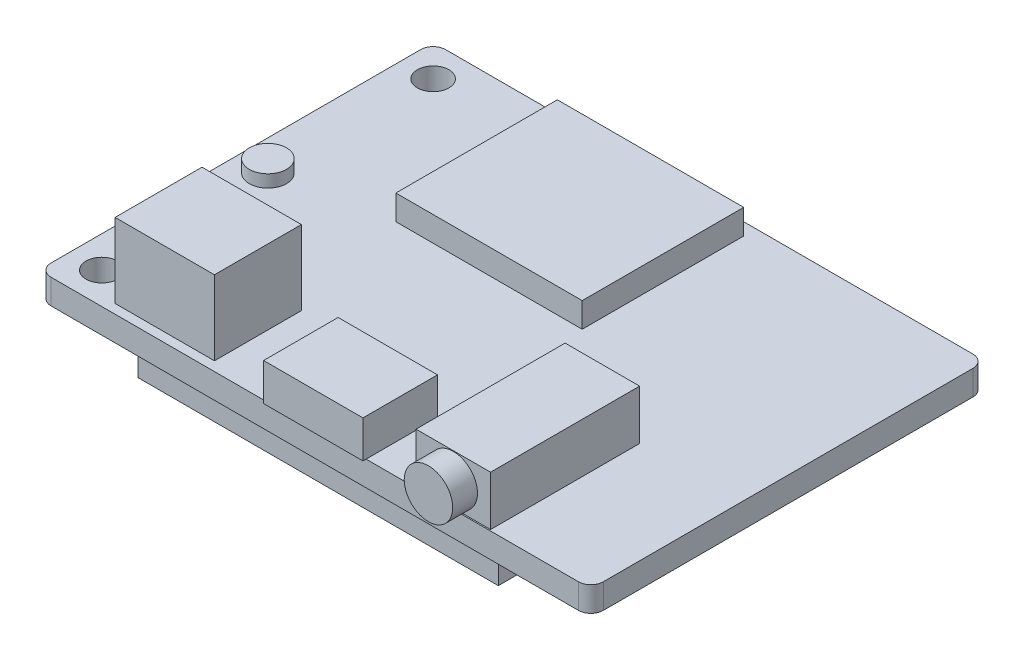
ISO-10303-21;
HEADER;
FILE_DESCRIPTION(('STEP AP214'),'2;1');
FILE_NAME('part.step','',(''),(''),'','','');
FILE_SCHEMA(('AUTOMOTIVE_DESIGN { 1 0 10303 214 1 1 1 1 }'));
ENDSEC;
DATA;
#1=APPLICATION_CONTEXT('core data for automotive mechanical design processes');
#2=APPLICATION_PROTOCOL_DEFINITION('international standard','automotive_design',2000,#1);
#3=PRODUCT_CONTEXT('',#1,'mechanical');
#4=PRODUCT('Part','Part','',(#3));
#5=PRODUCT_RELATED_PRODUCT_CATEGORY('part','',(#4));
#6=PRODUCT_DEFINITION_FORMATION('','',#4);
#7=PRODUCT_DEFINITION_CONTEXT('part definition',#1,'design');
#8=PRODUCT_DEFINITION('design','',#6,#7);
#9=PRODUCT_DEFINITION_SHAPE('','',#8);
#10=(LENGTH_UNIT() NAMED_UNIT(*) SI_UNIT(.MILLI.,.METRE.));
#11=(NAMED_UNIT(*) PLANE_ANGLE_UNIT() SI_UNIT($,.RADIAN.));
#12=(NAMED_UNIT(*) SI_UNIT($,.STERADIAN.) SOLID_ANGLE_UNIT());
#13=UNCERTAINTY_MEASURE_WITH_UNIT(LENGTH_MEASURE(1.E-05),#10,'distance_accuracy_value','');
#14=(GEOMETRIC_REPRESENTATION_CONTEXT(3) GLOBAL_UNCERTAINTY_ASSIGNED_CONTEXT((#13)) GLOBAL_UNIT_ASSIGNED_CONTEXT((#10,
#11,#12)) REPRESENTATION_CONTEXT('',''));
#15=CARTESIAN_POINT('',(0.,0.,0.));
#16=DIRECTION('',(0.,0.,1.));
#17=DIRECTION('',(1.,0.,0.));
#18=AXIS2_PLACEMENT_3D('',#15,#16,#17);
#19=CARTESIAN_POINT('',(0.,0.,0.));
#20=DIRECTION('',(0.,1.,0.));
#21=DIRECTION('',(0.,0.,1.));
#22=AXIS2_PLACEMENT_3D('',#19,#20,#21);
#23=PLANE('',#22);
#24=DIRECTION('',(0.,0.,-1.));
#25=VECTOR('',#24,1.);
#26=CARTESIAN_POINT('',(22.225,0.,-15.875));
#27=LINE('',#26,#25);
#28=CARTESIAN_POINT('',(22.225,0.,14.875));
#29=VERTEX_POINT('',#28);
#30=CARTESIAN_POINT('',(22.225,0.,-14.875));
#31=VERTEX_POINT('',#30);
#32=EDGE_CURVE('E391',#29,#31,#27,.T.);
#33=ORIENTED_EDGE('',*,*,#32,.F.);
#34=CARTESIAN_POINT('',(21.225,0.,14.875));
#35=DIRECTION('',(0.,1.,0.));
#36=DIRECTION('',(0.,0.,1.));
#37=AXIS2_PLACEMENT_3D('',#34,#35,#36);
#38=CIRCLE('',#37,1.);
#39=CARTESIAN_POINT('',(21.225,0.,15.875));
#40=VERTEX_POINT('',#39);
#41=EDGE_CURVE('E449',#29,#40,#38,.F.);
#42=ORIENTED_EDGE('',*,*,#41,.T.);
#43=DIRECTION('',(1.,0.,0.));
#44=VECTOR('',#43,1.);
#45=CARTESIAN_POINT('',(-22.225,0.,15.875));
#46=LINE('',#45,#44);
#47=CARTESIAN_POINT('',(-21.225,0.,15.875));
#48=VERTEX_POINT('',#47);
#49=EDGE_CURVE('E397',#48,#40,#46,.T.);
#50=ORIENTED_EDGE('',*,*,#49,.F.);
#51=CARTESIAN_POINT('',(-21.225,0.,14.875));
#52=DIRECTION('',(0.,1.,0.));
#53=DIRECTION('',(0.,0.,1.));
#54=AXIS2_PLACEMENT_3D('',#51,#52,#53);
#55=CIRCLE('',#54,1.);
#56=CARTESIAN_POINT('',(-22.225,0.,14.875));
#57=VERTEX_POINT('',#56);
#58=EDGE_CURVE('E429',#48,#57,#55,.F.);
#59=ORIENTED_EDGE('',*,*,#58,.T.);
#60=DIRECTION('',(0.,0.,1.));
#61=VECTOR('',#60,1.);
#62=CARTESIAN_POINT('',(-22.225,0.,-15.875));
#63=LINE('',#62,#61);
#64=CARTESIAN_POINT('',(-22.225,0.,-14.875));
#65=VERTEX_POINT('',#64);
#66=EDGE_CURVE('E411',#65,#57,#63,.T.);
#67=ORIENTED_EDGE('',*,*,#66,.F.);
#68=CARTESIAN_POINT('',(-21.225,0.,-14.875));
#69=DIRECTION('',(0.,1.,0.));
#70=DIRECTION('',(0.,0.,1.));
#71=AXIS2_PLACEMENT_3D('',#68,#69,#70);
#72=CIRCLE('',#71,1.);
#73=CARTESIAN_POINT('',(-21.225,0.,-15.875));
#74=VERTEX_POINT('',#73);
#75=EDGE_CURVE('E418',#65,#74,#72,.F.);
#76=ORIENTED_EDGE('',*,*,#75,.T.);
#77=DIRECTION('',(-1.,0.,0.));
#78=VECTOR('',#77,1.);
#79=CARTESIAN_POINT('',(-22.225,0.,-15.875));
#80=LINE('',#79,#78);
#81=CARTESIAN_POINT('',(21.225,0.,-15.875));
#82=VERTEX_POINT('',#81);
#83=EDGE_CURVE('E409',#82,#74,#80,.T.);
#84=ORIENTED_EDGE('',*,*,#83,.F.);
#85=CARTESIAN_POINT('',(21.225,0.,-14.875));
#86=DIRECTION('',(0.,1.,0.));
#87=DIRECTION('',(0.,0.,1.));
#88=AXIS2_PLACEMENT_3D('',#85,#86,#87);
#89=CIRCLE('',#88,1.);
#90=EDGE_CURVE('E438',#82,#31,#89,.F.);
#91=ORIENTED_EDGE('',*,*,#90,.T.);
#92=EDGE_LOOP('',(#33,#42,#50,#59,#67,#76,#84,#91));
#93=FACE_BOUND('',#92,.T.);
#94=CARTESIAN_POINT('',(-19.685,0.,13.335));
#95=DIRECTION('',(0.,1.,0.));
#96=DIRECTION('',(0.,0.,1.));
#97=AXIS2_PLACEMENT_3D('',#94,#95,#96);
#98=CIRCLE('',#97,1.27);
#99=CARTESIAN_POINT('',(-19.685,0.,14.605));
#100=VERTEX_POINT('',#99);
#101=EDGE_CURVE('E388',#100,#100,#98,.T.);
#102=ORIENTED_EDGE('',*,*,#101,.T.);
#103=EDGE_LOOP('',(#102));
#104=FACE_BOUND('',#103,.T.);
#105=CARTESIAN_POINT('',(-19.685,0.,-13.335));
#106=DIRECTION('',(0.,1.,0.));
#107=DIRECTION('',(0.,0.,1.));
#108=AXIS2_PLACEMENT_3D('',#105,#106,#107);
#109=CIRCLE('',#108,1.27);
#110=CARTESIAN_POINT('',(-19.685,0.,-12.065));
#111=VERTEX_POINT('',#110);
#112=EDGE_CURVE('E382',#111,#111,#109,.T.);
#113=ORIENTED_EDGE('',*,*,#112,.T.);
#114=EDGE_LOOP('',(#113));
#115=FACE_BOUND('',#114,.T.);
#116=DIRECTION('',(0.,0.,1.));
#117=VECTOR('',#116,1.);
#118=CARTESIAN_POINT('',(13.775,0.,-2.12500000000001));
#119=LINE('',#118,#117);
#120=CARTESIAN_POINT('',(13.775,0.,-2.12500000000001));
#121=VERTEX_POINT('',#120);
#122=CARTESIAN_POINT('',(13.775,0.,14.875));
#123=VERTEX_POINT('',#122);
#124=EDGE_CURVE('E245',#121,#123,#119,.T.);
#125=ORIENTED_EDGE('',*,*,#124,.F.);
#126=DIRECTION('',(1.,0.,0.));
#127=VECTOR('',#126,1.);
#128=CARTESIAN_POINT('',(-15.225,0.,-2.12500000000001));
#129=LINE('',#128,#127);
#130=CARTESIAN_POINT('',(-15.225,0.,-2.12500000000001));
#131=VERTEX_POINT('',#130);
#132=EDGE_CURVE('E242',#131,#121,#129,.T.);
#133=ORIENTED_EDGE('',*,*,#132,.F.);
#134=DIRECTION('',(0.,0.,-1.));
#135=VECTOR('',#134,1.);
#136=CARTESIAN_POINT('',(-15.225,0.,-2.12500000000001));
#137=LINE('',#136,#135);
#138=CARTESIAN_POINT('',(-15.225,0.,14.875));
#139=VERTEX_POINT('',#138);
#140=EDGE_CURVE('E54',#139,#131,#137,.T.);
#141=ORIENTED_EDGE('',*,*,#140,.F.);
#142=DIRECTION('',(-1.,0.,0.));
#143=VECTOR('',#142,1.);
#144=CARTESIAN_POINT('',(-15.225,0.,14.875));
#145=LINE('',#144,#143);
#146=EDGE_CURVE('E49',#123,#139,#145,.T.);
#147=ORIENTED_EDGE('',*,*,#146,.F.);
#148=EDGE_LOOP('',(#125,#133,#141,#147));
#149=FACE_BOUND('',#148,.T.);
#150=ADVANCED_FACE('F34',(#93,#104,#115,#149),#23,.F.);
#151=CARTESIAN_POINT('',(0.,2.,0.));
#152=DIRECTION('',(0.,1.,0.));
#153=DIRECTION('',(0.,0.,1.));
#154=AXIS2_PLACEMENT_3D('',#151,#152,#153);
#155=PLANE('',#154);
#156=CARTESIAN_POINT('',(-19.775,2.,-0.125000000000007));
#157=DIRECTION('',(0.,1.,0.));
#158=DIRECTION('',(0.,0.,1.));
#159=AXIS2_PLACEMENT_3D('',#156,#157,#158);
#160=CIRCLE('',#159,1.5);
#161=CARTESIAN_POINT('',(-19.775,2.,1.37499999999999));
#162=VERTEX_POINT('',#161);
#163=EDGE_CURVE('E280',#162,#162,#160,.T.);
#164=ORIENTED_EDGE('',*,*,#163,.F.);
#165=EDGE_LOOP('',(#164));
#166=FACE_BOUND('',#165,.T.);
#167=DIRECTION('',(-1.,0.,0.));
#168=VECTOR('',#167,1.);
#169=CARTESIAN_POINT('',(-3.873,2.,10.125));
#170=LINE('',#169,#168);
#171=CARTESIAN_POINT('',(4.127,2.,10.125));
#172=VERTEX_POINT('',#171);
#173=CARTESIAN_POINT('',(-3.873,2.,10.125));
#174=VERTEX_POINT('',#173);
#175=EDGE_CURVE('E333',#172,#174,#170,.T.);
#176=ORIENTED_EDGE('',*,*,#175,.F.);
#177=DIRECTION('',(0.,0.,-1.));
#178=VECTOR('',#177,1.);
#179=CARTESIAN_POINT('',(4.127,2.,10.125));
#180=LINE('',#179,#178);
#181=CARTESIAN_POINT('',(4.127,2.,15.875));
#182=VERTEX_POINT('',#181);
#183=EDGE_CURVE('E318',#182,#172,#180,.T.);
#184=ORIENTED_EDGE('',*,*,#183,.F.);
#185=DIRECTION('',(1.,0.,0.));
#186=VECTOR('',#185,1.);
#187=CARTESIAN_POINT('',(-22.225,2.,15.875));
#188=LINE('',#187,#186);
#189=CARTESIAN_POINT('',(21.225,2.,15.875));
#190=VERTEX_POINT('',#189);
#191=EDGE_CURVE('E402',#182,#190,#188,.T.);
#192=ORIENTED_EDGE('',*,*,#191,.T.);
#193=CARTESIAN_POINT('',(21.225,2.,14.875));
#194=DIRECTION('',(0.,1.,0.));
#195=DIRECTION('',(0.,0.,1.));
#196=AXIS2_PLACEMENT_3D('',#193,#194,#195);
#197=CIRCLE('',#196,1.);
#198=CARTESIAN_POINT('',(22.225,2.,14.875));
#199=VERTEX_POINT('',#198);
#200=EDGE_CURVE('E42',#190,#199,#197,.T.);
#201=ORIENTED_EDGE('',*,*,#200,.T.);
#202=DIRECTION('',(0.,0.,-1.));
#203=VECTOR('',#202,1.);
#204=CARTESIAN_POINT('',(22.225,2.,-15.875));
#205=LINE('',#204,#203);
#206=CARTESIAN_POINT('',(22.225,2.,-14.875));
#207=VERTEX_POINT('',#206);
#208=EDGE_CURVE('E394',#199,#207,#205,.T.);
#209=ORIENTED_EDGE('',*,*,#208,.T.);
#210=CARTESIAN_POINT('',(21.225,2.,-14.875));
#211=DIRECTION('',(0.,1.,0.));
#212=DIRECTION('',(0.,0.,1.));
#213=AXIS2_PLACEMENT_3D('',#210,#211,#212);
#214=CIRCLE('',#213,1.);
#215=CARTESIAN_POINT('',(21.225,2.,-15.875));
#216=VERTEX_POINT('',#215);
#217=EDGE_CURVE('E444',#207,#216,#214,.T.);
#218=ORIENTED_EDGE('',*,*,#217,.T.);
#219=DIRECTION('',(-1.,0.,0.));
#220=VECTOR('',#219,1.);
#221=CARTESIAN_POINT('',(-22.225,2.,-15.875));
#222=LINE('',#221,#220);
#223=CARTESIAN_POINT('',(-21.225,2.,-15.875));
#224=VERTEX_POINT('',#223);
#225=EDGE_CURVE('E396',#216,#224,#222,.T.);
#226=ORIENTED_EDGE('',*,*,#225,.T.);
#227=CARTESIAN_POINT('',(-21.225,2.,-14.875));
#228=DIRECTION('',(0.,1.,0.));
#229=DIRECTION('',(0.,0.,1.));
#230=AXIS2_PLACEMENT_3D('',#227,#228,#229);
#231=CIRCLE('',#230,1.);
#232=CARTESIAN_POINT('',(-22.225,2.,-14.875));
#233=VERTEX_POINT('',#232);
#234=EDGE_CURVE('E424',#224,#233,#231,.T.);
#235=ORIENTED_EDGE('',*,*,#234,.T.);
#236=DIRECTION('',(0.,0.,1.));
#237=VECTOR('',#236,1.);
#238=CARTESIAN_POINT('',(-22.225,2.,-15.875));
#239=LINE('',#238,#237);
#240=CARTESIAN_POINT('',(-22.225,2.,14.875));
#241=VERTEX_POINT('',#240);
#242=EDGE_CURVE('E399',#233,#241,#239,.T.);
#243=ORIENTED_EDGE('',*,*,#242,.T.);
#244=CARTESIAN_POINT('',(-21.225,2.,14.875));
#245=DIRECTION('',(0.,1.,0.));
#246=DIRECTION('',(0.,0.,1.));
#247=AXIS2_PLACEMENT_3D('',#244,#245,#246);
#248=CIRCLE('',#247,1.);
#249=CARTESIAN_POINT('',(-21.225,2.,15.875));
#250=VERTEX_POINT('',#249);
#251=EDGE_CURVE('E433',#241,#250,#248,.T.);
#252=ORIENTED_EDGE('',*,*,#251,.T.);
#253=CARTESIAN_POINT('',(-3.873,2.,15.875));
#254=VERTEX_POINT('',#253);
#255=EDGE_CURVE('E403',#250,#254,#188,.T.);
#256=ORIENTED_EDGE('',*,*,#255,.T.);
#257=DIRECTION('',(0.,0.,1.));
#258=VECTOR('',#257,1.);
#259=CARTESIAN_POINT('',(-3.873,2.,10.125));
#260=LINE('',#259,#258);
#261=EDGE_CURVE('E337',#174,#254,#260,.T.);
#262=ORIENTED_EDGE('',*,*,#261,.F.);
#263=EDGE_LOOP('',(#176,#184,#192,#201,#209,#218,#226,#235,#243,#252,#256,#262));
#264=FACE_BOUND('',#263,.T.);
#265=CARTESIAN_POINT('',(-19.685,2.,13.335));
#266=DIRECTION('',(0.,1.,0.));
#267=DIRECTION('',(0.,0.,1.));
#268=AXIS2_PLACEMENT_3D('',#265,#266,#267);
#269=CIRCLE('',#268,1.27);
#270=CARTESIAN_POINT('',(-19.685,2.,14.605));
#271=VERTEX_POINT('',#270);
#272=EDGE_CURVE('E385',#271,#271,#269,.T.);
#273=ORIENTED_EDGE('',*,*,#272,.F.);
#274=EDGE_LOOP('',(#273));
#275=FACE_BOUND('',#274,.T.);
#276=CARTESIAN_POINT('',(-19.685,2.,-13.335));
#277=DIRECTION('',(0.,1.,0.));
#278=DIRECTION('',(0.,0.,1.));
#279=AXIS2_PLACEMENT_3D('',#276,#277,#278);
#280=CIRCLE('',#279,1.27);
#281=CARTESIAN_POINT('',(-19.685,2.,-12.065));
#282=VERTEX_POINT('',#281);
#283=EDGE_CURVE('E381',#282,#282,#280,.T.);
#284=ORIENTED_EDGE('',*,*,#283,.F.);
#285=EDGE_LOOP('',(#284));
#286=FACE_BOUND('',#285,.T.);
#287=DIRECTION('',(-1.,0.,0.));
#288=VECTOR('',#287,1.);
#289=CARTESIAN_POINT('',(-16.827,2.,8.12499999999999));
#290=LINE('',#289,#288);
#291=CARTESIAN_POINT('',(-8.827,2.,8.12499999999999));
#292=VERTEX_POINT('',#291);
#293=CARTESIAN_POINT('',(-16.827,2.,8.12499999999999));
#294=VERTEX_POINT('',#293);
#295=EDGE_CURVE('E366',#292,#294,#290,.T.);
#296=ORIENTED_EDGE('',*,*,#295,.F.);
#297=DIRECTION('',(0.,0.,-1.));
#298=VECTOR('',#297,1.);
#299=CARTESIAN_POINT('',(-8.827,2.,15.125));
#300=LINE('',#299,#298);
#301=CARTESIAN_POINT('',(-8.827,2.,15.125));
#302=VERTEX_POINT('',#301);
#303=EDGE_CURVE('E352',#302,#292,#300,.T.);
#304=ORIENTED_EDGE('',*,*,#303,.F.);
#305=DIRECTION('',(1.,0.,0.));
#306=VECTOR('',#305,1.);
#307=CARTESIAN_POINT('',(-16.827,2.,15.125));
#308=LINE('',#307,#306);
#309=CARTESIAN_POINT('',(-16.827,2.,15.125));
#310=VERTEX_POINT('',#309);
#311=EDGE_CURVE('E357',#310,#302,#308,.T.);
#312=ORIENTED_EDGE('',*,*,#311,.F.);
#313=DIRECTION('',(0.,0.,1.));
#314=VECTOR('',#313,1.);
#315=CARTESIAN_POINT('',(-16.827,2.,15.125));
#316=LINE('',#315,#314);
#317=EDGE_CURVE('E368',#294,#310,#316,.T.);
#318=ORIENTED_EDGE('',*,*,#317,.F.);
#319=EDGE_LOOP('',(#296,#304,#312,#318));
#320=FACE_BOUND('',#319,.T.);
#321=DIRECTION('',(-1.,0.,0.));
#322=VECTOR('',#321,1.);
#323=CARTESIAN_POINT('',(8.049,2.,3.77499999999999));
#324=LINE('',#323,#322);
#325=CARTESIAN_POINT('',(14.049,2.,3.77499999999999));
#326=VERTEX_POINT('',#325);
#327=CARTESIAN_POINT('',(8.049,2.,3.77499999999999));
#328=VERTEX_POINT('',#327);
#329=EDGE_CURVE('E303',#326,#328,#324,.T.);
#330=ORIENTED_EDGE('',*,*,#329,.F.);
#331=DIRECTION('',(0.,0.,-1.));
#332=VECTOR('',#331,1.);
#333=CARTESIAN_POINT('',(14.049,2.,3.77499999999999));
#334=LINE('',#333,#332);
#335=CARTESIAN_POINT('',(14.049,2.,15.775));
#336=VERTEX_POINT('',#335);
#337=EDGE_CURVE('E289',#336,#326,#334,.T.);
#338=ORIENTED_EDGE('',*,*,#337,.F.);
#339=DIRECTION('',(1.,0.,0.));
#340=VECTOR('',#339,1.);
#341=CARTESIAN_POINT('',(8.049,2.,15.775));
#342=LINE('',#341,#340);
#343=CARTESIAN_POINT('',(8.049,2.,15.775));
#344=VERTEX_POINT('',#343);
#345=EDGE_CURVE('E294',#344,#336,#342,.T.);
#346=ORIENTED_EDGE('',*,*,#345,.F.);
#347=DIRECTION('',(0.,0.,1.));
#348=VECTOR('',#347,1.);
#349=CARTESIAN_POINT('',(8.049,2.,3.77499999999999));
#350=LINE('',#349,#348);
#351=EDGE_CURVE('E305',#328,#344,#350,.T.);
#352=ORIENTED_EDGE('',*,*,#351,.F.);
#353=EDGE_LOOP('',(#330,#338,#346,#352));
#354=FACE_BOUND('',#353,.T.);
#355=DIRECTION('',(1.,0.,0.));
#356=VECTOR('',#355,1.);
#357=CARTESIAN_POINT('',(3.77499999999999,2.,-1.87500000000001));
#358=LINE('',#357,#356);
#359=CARTESIAN_POINT('',(-11.225,2.,-1.87500000000001));
#360=VERTEX_POINT('',#359);
#361=CARTESIAN_POINT('',(3.77499999999999,2.,-1.87500000000001));
#362=VERTEX_POINT('',#361);
#363=EDGE_CURVE('E249',#360,#362,#358,.T.);
#364=ORIENTED_EDGE('',*,*,#363,.F.);
#365=DIRECTION('',(0.,0.,1.));
#366=VECTOR('',#365,1.);
#367=CARTESIAN_POINT('',(-11.225,2.,-1.87500000000001));
#368=LINE('',#367,#366);
#369=CARTESIAN_POINT('',(-11.225,2.,-14.875));
#370=VERTEX_POINT('',#369);
#371=EDGE_CURVE('E246',#370,#360,#368,.T.);
#372=ORIENTED_EDGE('',*,*,#371,.F.);
#373=DIRECTION('',(-1.,0.,0.));
#374=VECTOR('',#373,1.);
#375=CARTESIAN_POINT('',(3.77499999999999,2.,-14.875));
#376=LINE('',#375,#374);
#377=CARTESIAN_POINT('',(3.77499999999999,2.,-14.875));
#378=VERTEX_POINT('',#377);
#379=EDGE_CURVE('E259',#378,#370,#376,.T.);
#380=ORIENTED_EDGE('',*,*,#379,.F.);
#381=DIRECTION('',(0.,0.,-1.));
#382=VECTOR('',#381,1.);
#383=CARTESIAN_POINT('',(3.77499999999999,2.,-1.87500000000001));
#384=LINE('',#383,#382);
#385=EDGE_CURVE('E267',#362,#378,#384,.T.);
#386=ORIENTED_EDGE('',*,*,#385,.F.);
#387=EDGE_LOOP('',(#364,#372,#380,#386));
#388=FACE_BOUND('',#387,.T.);
#389=ADVANCED_FACE('F456',(#166,#264,#275,#286,#320,#354,#388),#155,.T.);
#390=CARTESIAN_POINT('',(8.049,6.,15.775));
#391=DIRECTION('',(0.,0.,-1.));
#392=DIRECTION('',(-1.,0.,0.));
#393=AXIS2_PLACEMENT_3D('',#390,#391,#392);
#394=PLANE('',#393);
#395=ORIENTED_EDGE('',*,*,#345,.T.);
#396=DIRECTION('',(0.,-1.,0.));
#397=VECTOR('',#396,1.);
#398=CARTESIAN_POINT('',(14.049,6.,15.775));
#399=LINE('',#398,#397);
#400=CARTESIAN_POINT('',(14.049,6.,15.775));
#401=VERTEX_POINT('',#400);
#402=EDGE_CURVE('E300',#401,#336,#399,.T.);
#403=ORIENTED_EDGE('',*,*,#402,.F.);
#404=DIRECTION('',(1.,0.,0.));
#405=VECTOR('',#404,1.);
#406=CARTESIAN_POINT('',(8.049,6.,15.775));
#407=LINE('',#406,#405);
#408=CARTESIAN_POINT('',(8.049,6.,15.775));
#409=VERTEX_POINT('',#408);
#410=EDGE_CURVE('E298',#409,#401,#407,.T.);
#411=ORIENTED_EDGE('',*,*,#410,.F.);
#412=DIRECTION('',(0.,-1.,0.));
#413=VECTOR('',#412,1.);
#414=CARTESIAN_POINT('',(8.049,6.,15.775));
#415=LINE('',#414,#413);
#416=EDGE_CURVE('E311',#409,#344,#415,.T.);
#417=ORIENTED_EDGE('',*,*,#416,.T.);
#418=EDGE_LOOP('',(#395,#403,#411,#417));
#419=FACE_BOUND('',#418,.T.);
#420=CARTESIAN_POINT('',(11.049,4.,15.775));
#421=DIRECTION('',(0.,0.,-1.));
#422=DIRECTION('',(-1.,0.,0.));
#423=AXIS2_PLACEMENT_3D('',#420,#421,#422);
#424=CIRCLE('',#423,1.95);
#425=CARTESIAN_POINT('',(9.099,4.,15.775));
#426=VERTEX_POINT('',#425);
#427=EDGE_CURVE('E11',#426,#426,#424,.F.);
#428=ORIENTED_EDGE('',*,*,#427,.F.);
#429=EDGE_LOOP('',(#428));
#430=FACE_BOUND('',#429,.T.);
#431=ADVANCED_FACE('F535',(#419,#430),#394,.F.);
#432=CARTESIAN_POINT('',(22.225,2.,-15.875));
#433=DIRECTION('',(-1.,0.,0.));
#434=DIRECTION('',(0.,0.,1.));
#435=AXIS2_PLACEMENT_3D('',#432,#433,#434);
#436=PLANE('',#435);
#437=ORIENTED_EDGE('',*,*,#208,.F.);
#438=DIRECTION('',(0.,-1.,0.));
#439=VECTOR('',#438,1.);
#440=CARTESIAN_POINT('',(22.225,2.,14.875));
#441=LINE('',#440,#439);
#442=EDGE_CURVE('E446',#199,#29,#441,.T.);
#443=ORIENTED_EDGE('',*,*,#442,.T.);
#444=ORIENTED_EDGE('',*,*,#32,.T.);
#445=DIRECTION('',(0.,-1.,0.));
#446=VECTOR('',#445,1.);
#447=CARTESIAN_POINT('',(22.225,2.,-14.875));
#448=LINE('',#447,#446);
#449=EDGE_CURVE('E441',#31,#207,#448,.F.);
#450=ORIENTED_EDGE('',*,*,#449,.T.);
#451=EDGE_LOOP('',(#437,#443,#444,#450));
#452=FACE_BOUND('',#451,.T.);
#453=ADVANCED_FACE('F463',(#452),#436,.F.);
#454=CARTESIAN_POINT('',(-22.225,2.,-15.875));
#455=DIRECTION('',(0.,0.,1.));
#456=DIRECTION('',(1.,0.,0.));
#457=AXIS2_PLACEMENT_3D('',#454,#455,#456);
#458=PLANE('',#457);
#459=ORIENTED_EDGE('',*,*,#225,.F.);
#460=DIRECTION('',(0.,-1.,0.));
#461=VECTOR('',#460,1.);
#462=CARTESIAN_POINT('',(21.225,2.,-15.875));
#463=LINE('',#462,#461);
#464=EDGE_CURVE('E435',#216,#82,#463,.T.);
#465=ORIENTED_EDGE('',*,*,#464,.T.);
#466=ORIENTED_EDGE('',*,*,#83,.T.);
#467=DIRECTION('',(0.,-1.,0.));
#468=VECTOR('',#467,1.);
#469=CARTESIAN_POINT('',(-21.225,2.,-15.875));
#470=LINE('',#469,#468);
#471=EDGE_CURVE('E421',#74,#224,#470,.F.);
#472=ORIENTED_EDGE('',*,*,#471,.T.);
#473=EDGE_LOOP('',(#459,#465,#466,#472));
#474=FACE_BOUND('',#473,.T.);
#475=ADVANCED_FACE('F490',(#474),#458,.F.);
#476=CARTESIAN_POINT('',(-22.225,2.,-15.875));
#477=DIRECTION('',(1.,0.,0.));
#478=DIRECTION('',(0.,0.,-1.));
#479=AXIS2_PLACEMENT_3D('',#476,#477,#478);
#480=PLANE('',#479);
#481=ORIENTED_EDGE('',*,*,#66,.T.);
#482=DIRECTION('',(0.,-1.,0.));
#483=VECTOR('',#482,1.);
#484=CARTESIAN_POINT('',(-22.225,2.,14.875));
#485=LINE('',#484,#483);
#486=EDGE_CURVE('E431',#57,#241,#485,.F.);
#487=ORIENTED_EDGE('',*,*,#486,.T.);
#488=ORIENTED_EDGE('',*,*,#242,.F.);
#489=DIRECTION('',(0.,-1.,0.));
#490=VECTOR('',#489,1.);
#491=CARTESIAN_POINT('',(-22.225,2.,-14.875));
#492=LINE('',#491,#490);
#493=EDGE_CURVE('E406',#233,#65,#492,.T.);
#494=ORIENTED_EDGE('',*,*,#493,.T.);
#495=EDGE_LOOP('',(#481,#487,#488,#494));
#496=FACE_BOUND('',#495,.T.);
#497=ADVANCED_FACE('F480',(#496),#480,.F.);
#498=CARTESIAN_POINT('',(-22.225,2.,15.875));
#499=DIRECTION('',(0.,0.,-1.));
#500=DIRECTION('',(-1.,0.,0.));
#501=AXIS2_PLACEMENT_3D('',#498,#499,#500);
#502=PLANE('',#501);
#503=ORIENTED_EDGE('',*,*,#49,.T.);
#504=DIRECTION('',(0.,-1.,0.));
#505=VECTOR('',#504,1.);
#506=CARTESIAN_POINT('',(21.225,2.,15.875));
#507=LINE('',#506,#505);
#508=EDGE_CURVE('E451',#40,#190,#507,.F.);
#509=ORIENTED_EDGE('',*,*,#508,.T.);
#510=ORIENTED_EDGE('',*,*,#191,.F.);
#511=EDGE_CURVE('E407',#254,#182,#188,.T.);
#512=ORIENTED_EDGE('',*,*,#511,.F.);
#513=ORIENTED_EDGE('',*,*,#255,.F.);
#514=DIRECTION('',(0.,-1.,0.));
#515=VECTOR('',#514,1.);
#516=CARTESIAN_POINT('',(-21.225,2.,15.875));
#517=LINE('',#516,#515);
#518=EDGE_CURVE('E426',#250,#48,#517,.T.);
#519=ORIENTED_EDGE('',*,*,#518,.T.);
#520=EDGE_LOOP('',(#503,#509,#510,#512,#513,#519));
#521=FACE_BOUND('',#520,.T.);
#522=ADVANCED_FACE('F471',(#521),#502,.F.);
#523=CARTESIAN_POINT('',(-19.685,0.,13.335));
#524=DIRECTION('',(0.,1.,0.));
#525=DIRECTION('',(0.,0.,1.));
#526=AXIS2_PLACEMENT_3D('',#523,#524,#525);
#527=CYLINDRICAL_SURFACE('',#526,1.27);
#528=ORIENTED_EDGE('',*,*,#101,.F.);
#529=EDGE_LOOP('',(#528));
#530=FACE_BOUND('',#529,.T.);
#531=ORIENTED_EDGE('',*,*,#272,.T.);
#532=EDGE_LOOP('',(#531));
#533=FACE_BOUND('',#532,.T.);
#534=ADVANCED_FACE('F542',(#530,#533),#527,.F.);
#535=CARTESIAN_POINT('',(-19.685,0.,-13.335));
#536=DIRECTION('',(0.,1.,0.));
#537=DIRECTION('',(0.,0.,1.));
#538=AXIS2_PLACEMENT_3D('',#535,#536,#537);
#539=CYLINDRICAL_SURFACE('',#538,1.27);
#540=ORIENTED_EDGE('',*,*,#112,.F.);
#541=EDGE_LOOP('',(#540));
#542=FACE_BOUND('',#541,.T.);
#543=ORIENTED_EDGE('',*,*,#283,.T.);
#544=EDGE_LOOP('',(#543));
#545=FACE_BOUND('',#544,.T.);
#546=ADVANCED_FACE('F551',(#542,#545),#539,.F.);
#547=CARTESIAN_POINT('',(-21.225,2.,-14.875));
#548=DIRECTION('',(0.,-1.,0.));
#549=DIRECTION('',(0.,0.,-1.));
#550=AXIS2_PLACEMENT_3D('',#547,#548,#549);
#551=CYLINDRICAL_SURFACE('',#550,1.);
#552=ORIENTED_EDGE('',*,*,#234,.F.);
#553=ORIENTED_EDGE('',*,*,#471,.F.);
#554=ORIENTED_EDGE('',*,*,#75,.F.);
#555=ORIENTED_EDGE('',*,*,#493,.F.);
#556=EDGE_LOOP('',(#552,#553,#554,#555));
#557=FACE_BOUND('',#556,.T.);
#558=ADVANCED_FACE('F485',(#557),#551,.T.);
#559=CARTESIAN_POINT('',(-21.225,2.,14.875));
#560=DIRECTION('',(0.,-1.,0.));
#561=DIRECTION('',(0.,0.,-1.));
#562=AXIS2_PLACEMENT_3D('',#559,#560,#561);
#563=CYLINDRICAL_SURFACE('',#562,1.);
#564=ORIENTED_EDGE('',*,*,#251,.F.);
#565=ORIENTED_EDGE('',*,*,#486,.F.);
#566=ORIENTED_EDGE('',*,*,#58,.F.);
#567=ORIENTED_EDGE('',*,*,#518,.F.);
#568=EDGE_LOOP('',(#564,#565,#566,#567));
#569=FACE_BOUND('',#568,.T.);
#570=ADVANCED_FACE('F476',(#569),#563,.T.);
#571=CARTESIAN_POINT('',(21.225,2.,-14.875));
#572=DIRECTION('',(0.,-1.,0.));
#573=DIRECTION('',(0.,0.,-1.));
#574=AXIS2_PLACEMENT_3D('',#571,#572,#573);
#575=CYLINDRICAL_SURFACE('',#574,1.);
#576=ORIENTED_EDGE('',*,*,#217,.F.);
#577=ORIENTED_EDGE('',*,*,#449,.F.);
#578=ORIENTED_EDGE('',*,*,#90,.F.);
#579=ORIENTED_EDGE('',*,*,#464,.F.);
#580=EDGE_LOOP('',(#576,#577,#578,#579));
#581=FACE_BOUND('',#580,.T.);
#582=ADVANCED_FACE('F493',(#581),#575,.T.);
#583=CARTESIAN_POINT('',(21.225,2.,14.875));
#584=DIRECTION('',(0.,-1.,0.));
#585=DIRECTION('',(0.,0.,-1.));
#586=AXIS2_PLACEMENT_3D('',#583,#584,#585);
#587=CYLINDRICAL_SURFACE('',#586,1.);
#588=ORIENTED_EDGE('',*,*,#200,.F.);
#589=ORIENTED_EDGE('',*,*,#508,.F.);
#590=ORIENTED_EDGE('',*,*,#41,.F.);
#591=ORIENTED_EDGE('',*,*,#442,.F.);
#592=EDGE_LOOP('',(#588,#589,#590,#591));
#593=FACE_BOUND('',#592,.T.);
#594=ADVANCED_FACE('F36',(#593),#587,.T.);
#595=CARTESIAN_POINT('',(-8.827,8.,15.125));
#596=DIRECTION('',(-1.,0.,0.));
#597=DIRECTION('',(0.,0.,1.));
#598=AXIS2_PLACEMENT_3D('',#595,#596,#597);
#599=PLANE('',#598);
#600=ORIENTED_EDGE('',*,*,#303,.T.);
#601=DIRECTION('',(0.,-1.,0.));
#602=VECTOR('',#601,1.);
#603=CARTESIAN_POINT('',(-8.827,8.,8.12499999999999));
#604=LINE('',#603,#602);
#605=CARTESIAN_POINT('',(-8.827,8.,8.12499999999999));
#606=VERTEX_POINT('',#605);
#607=EDGE_CURVE('E379',#606,#292,#604,.T.);
#608=ORIENTED_EDGE('',*,*,#607,.F.);
#609=DIRECTION('',(0.,0.,-1.));
#610=VECTOR('',#609,1.);
#611=CARTESIAN_POINT('',(-8.827,8.,15.125));
#612=LINE('',#611,#610);
#613=CARTESIAN_POINT('',(-8.827,8.,15.125));
#614=VERTEX_POINT('',#613);
#615=EDGE_CURVE('E353',#614,#606,#612,.T.);
#616=ORIENTED_EDGE('',*,*,#615,.F.);
#617=DIRECTION('',(0.,-1.,0.));
#618=VECTOR('',#617,1.);
#619=CARTESIAN_POINT('',(-8.827,8.,15.125));
#620=LINE('',#619,#618);
#621=EDGE_CURVE('E363',#614,#302,#620,.T.);
#622=ORIENTED_EDGE('',*,*,#621,.T.);
#623=EDGE_LOOP('',(#600,#608,#616,#622));
#624=FACE_BOUND('',#623,.T.);
#625=ADVANCED_FACE('F557',(#624),#599,.F.);
#626=CARTESIAN_POINT('',(-16.827,8.,8.12499999999999));
#627=DIRECTION('',(0.,0.,1.));
#628=DIRECTION('',(1.,0.,0.));
#629=AXIS2_PLACEMENT_3D('',#626,#627,#628);
#630=PLANE('',#629);
#631=ORIENTED_EDGE('',*,*,#295,.T.);
#632=DIRECTION('',(0.,-1.,0.));
#633=VECTOR('',#632,1.);
#634=CARTESIAN_POINT('',(-16.827,8.,8.12499999999999));
#635=LINE('',#634,#633);
#636=CARTESIAN_POINT('',(-16.827,8.,8.12499999999999));
#637=VERTEX_POINT('',#636);
#638=EDGE_CURVE('E376',#637,#294,#635,.T.);
#639=ORIENTED_EDGE('',*,*,#638,.F.);
#640=DIRECTION('',(-1.,0.,0.));
#641=VECTOR('',#640,1.);
#642=CARTESIAN_POINT('',(-16.827,8.,8.12499999999999));
#643=LINE('',#642,#641);
#644=EDGE_CURVE('E356',#606,#637,#643,.T.);
#645=ORIENTED_EDGE('',*,*,#644,.F.);
#646=ORIENTED_EDGE('',*,*,#607,.T.);
#647=EDGE_LOOP('',(#631,#639,#645,#646));
#648=FACE_BOUND('',#647,.T.);
#649=ADVANCED_FACE('F561',(#648),#630,.F.);
#650=CARTESIAN_POINT('',(-16.827,8.,15.125));
#651=DIRECTION('',(1.,0.,0.));
#652=DIRECTION('',(0.,0.,-1.));
#653=AXIS2_PLACEMENT_3D('',#650,#651,#652);
#654=PLANE('',#653);
#655=ORIENTED_EDGE('',*,*,#317,.T.);
#656=DIRECTION('',(0.,-1.,0.));
#657=VECTOR('',#656,1.);
#658=CARTESIAN_POINT('',(-16.827,8.,15.125));
#659=LINE('',#658,#657);
#660=CARTESIAN_POINT('',(-16.827,8.,15.125));
#661=VERTEX_POINT('',#660);
#662=EDGE_CURVE('E374',#661,#310,#659,.T.);
#663=ORIENTED_EDGE('',*,*,#662,.F.);
#664=DIRECTION('',(0.,0.,1.));
#665=VECTOR('',#664,1.);
#666=CARTESIAN_POINT('',(-16.827,8.,15.125));
#667=LINE('',#666,#665);
#668=EDGE_CURVE('E359',#637,#661,#667,.T.);
#669=ORIENTED_EDGE('',*,*,#668,.F.);
#670=ORIENTED_EDGE('',*,*,#638,.T.);
#671=EDGE_LOOP('',(#655,#663,#669,#670));
#672=FACE_BOUND('',#671,.T.);
#673=ADVANCED_FACE('F567',(#672),#654,.F.);
#674=CARTESIAN_POINT('',(-16.827,8.,15.125));
#675=DIRECTION('',(0.,0.,-1.));
#676=DIRECTION('',(-1.,0.,0.));
#677=AXIS2_PLACEMENT_3D('',#674,#675,#676);
#678=PLANE('',#677);
#679=ORIENTED_EDGE('',*,*,#311,.T.);
#680=ORIENTED_EDGE('',*,*,#621,.F.);
#681=DIRECTION('',(1.,0.,0.));
#682=VECTOR('',#681,1.);
#683=CARTESIAN_POINT('',(-16.827,8.,15.125));
#684=LINE('',#683,#682);
#685=EDGE_CURVE('E361',#661,#614,#684,.T.);
#686=ORIENTED_EDGE('',*,*,#685,.F.);
#687=ORIENTED_EDGE('',*,*,#662,.T.);
#688=EDGE_LOOP('',(#679,#680,#686,#687));
#689=FACE_BOUND('',#688,.T.);
#690=ADVANCED_FACE('F856',(#689),#678,.F.);
#691=CARTESIAN_POINT('',(0.,8.,0.));
#692=DIRECTION('',(0.,-1.,0.));
#693=DIRECTION('',(0.,0.,-1.));
#694=AXIS2_PLACEMENT_3D('',#691,#692,#693);
#695=PLANE('',#694);
#696=ORIENTED_EDGE('',*,*,#615,.T.);
#697=ORIENTED_EDGE('',*,*,#644,.T.);
#698=ORIENTED_EDGE('',*,*,#668,.T.);
#699=ORIENTED_EDGE('',*,*,#685,.T.);
#700=EDGE_LOOP('',(#696,#697,#698,#699));
#701=FACE_BOUND('',#700,.T.);
#702=ADVANCED_FACE('F848',(#701),#695,.F.);
#703=CARTESIAN_POINT('',(0.,2.,0.));
#704=DIRECTION('',(0.,1.,0.));
#705=DIRECTION('',(0.,0.,1.));
#706=AXIS2_PLACEMENT_3D('',#703,#704,#705);
#707=PLANE('',#706);
#708=CARTESIAN_POINT('',(-3.873,2.,16.125));
#709=VERTEX_POINT('',#708);
#710=EDGE_CURVE('E336',#254,#709,#260,.T.);
#711=ORIENTED_EDGE('',*,*,#710,.F.);
#712=ORIENTED_EDGE('',*,*,#511,.T.);
#713=CARTESIAN_POINT('',(4.127,2.,16.125));
#714=VERTEX_POINT('',#713);
#715=EDGE_CURVE('E330',#714,#182,#180,.T.);
#716=ORIENTED_EDGE('',*,*,#715,.F.);
#717=DIRECTION('',(1.,0.,0.));
#718=VECTOR('',#717,1.);
#719=CARTESIAN_POINT('',(-3.873,2.,16.125));
#720=LINE('',#719,#718);
#721=EDGE_CURVE('E323',#709,#714,#720,.T.);
#722=ORIENTED_EDGE('',*,*,#721,.F.);
#723=EDGE_LOOP('',(#711,#712,#716,#722));
#724=FACE_BOUND('',#723,.T.);
#725=ADVANCED_FACE('F498',(#724),#707,.F.);
#726=CARTESIAN_POINT('',(4.127,5.,10.125));
#727=DIRECTION('',(-1.,0.,0.));
#728=DIRECTION('',(0.,0.,1.));
#729=AXIS2_PLACEMENT_3D('',#726,#727,#728);
#730=PLANE('',#729);
#731=ORIENTED_EDGE('',*,*,#715,.T.);
#732=ORIENTED_EDGE('',*,*,#183,.T.);
#733=DIRECTION('',(0.,-1.,0.));
#734=VECTOR('',#733,1.);
#735=CARTESIAN_POINT('',(4.127,5.,10.125));
#736=LINE('',#735,#734);
#737=CARTESIAN_POINT('',(4.127,5.,10.125));
#738=VERTEX_POINT('',#737);
#739=EDGE_CURVE('E349',#738,#172,#736,.T.);
#740=ORIENTED_EDGE('',*,*,#739,.F.);
#741=DIRECTION('',(0.,0.,-1.));
#742=VECTOR('',#741,1.);
#743=CARTESIAN_POINT('',(4.127,5.,10.125));
#744=LINE('',#743,#742);
#745=CARTESIAN_POINT('',(4.127,5.,16.125));
#746=VERTEX_POINT('',#745);
#747=EDGE_CURVE('E319',#746,#738,#744,.T.);
#748=ORIENTED_EDGE('',*,*,#747,.F.);
#749=DIRECTION('',(0.,-1.,0.));
#750=VECTOR('',#749,1.);
#751=CARTESIAN_POINT('',(4.127,5.,16.125));
#752=LINE('',#751,#750);
#753=EDGE_CURVE('E329',#746,#714,#752,.T.);
#754=ORIENTED_EDGE('',*,*,#753,.T.);
#755=EDGE_LOOP('',(#731,#732,#740,#748,#754));
#756=FACE_BOUND('',#755,.T.);
#757=ADVANCED_FACE('F510',(#756),#730,.F.);
#758=CARTESIAN_POINT('',(-3.873,5.,10.125));
#759=DIRECTION('',(0.,0.,1.));
#760=DIRECTION('',(1.,0.,0.));
#761=AXIS2_PLACEMENT_3D('',#758,#759,#760);
#762=PLANE('',#761);
#763=ORIENTED_EDGE('',*,*,#175,.T.);
#764=DIRECTION('',(0.,-1.,0.));
#765=VECTOR('',#764,1.);
#766=CARTESIAN_POINT('',(-3.873,5.,10.125));
#767=LINE('',#766,#765);
#768=CARTESIAN_POINT('',(-3.873,5.,10.125));
#769=VERTEX_POINT('',#768);
#770=EDGE_CURVE('E346',#769,#174,#767,.T.);
#771=ORIENTED_EDGE('',*,*,#770,.F.);
#772=DIRECTION('',(-1.,0.,0.));
#773=VECTOR('',#772,1.);
#774=CARTESIAN_POINT('',(-3.873,5.,10.125));
#775=LINE('',#774,#773);
#776=EDGE_CURVE('E322',#738,#769,#775,.T.);
#777=ORIENTED_EDGE('',*,*,#776,.F.);
#778=ORIENTED_EDGE('',*,*,#739,.T.);
#779=EDGE_LOOP('',(#763,#771,#777,#778));
#780=FACE_BOUND('',#779,.T.);
#781=ADVANCED_FACE('F506',(#780),#762,.F.);
#782=CARTESIAN_POINT('',(-3.873,5.,10.125));
#783=DIRECTION('',(1.,0.,0.));
#784=DIRECTION('',(0.,0.,-1.));
#785=AXIS2_PLACEMENT_3D('',#782,#783,#784);
#786=PLANE('',#785);
#787=ORIENTED_EDGE('',*,*,#261,.T.);
#788=ORIENTED_EDGE('',*,*,#710,.T.);
#789=DIRECTION('',(0.,-1.,0.));
#790=VECTOR('',#789,1.);
#791=CARTESIAN_POINT('',(-3.873,5.,16.125));
#792=LINE('',#791,#790);
#793=CARTESIAN_POINT('',(-3.873,5.,16.125));
#794=VERTEX_POINT('',#793);
#795=EDGE_CURVE('E343',#794,#709,#792,.T.);
#796=ORIENTED_EDGE('',*,*,#795,.F.);
#797=DIRECTION('',(0.,0.,1.));
#798=VECTOR('',#797,1.);
#799=CARTESIAN_POINT('',(-3.873,5.,10.125));
#800=LINE('',#799,#798);
#801=EDGE_CURVE('E325',#769,#794,#800,.T.);
#802=ORIENTED_EDGE('',*,*,#801,.F.);
#803=ORIENTED_EDGE('',*,*,#770,.T.);
#804=EDGE_LOOP('',(#787,#788,#796,#802,#803));
#805=FACE_BOUND('',#804,.T.);
#806=ADVANCED_FACE('F502',(#805),#786,.F.);
#807=CARTESIAN_POINT('',(-3.873,5.,16.125));
#808=DIRECTION('',(0.,0.,-1.));
#809=DIRECTION('',(-1.,0.,0.));
#810=AXIS2_PLACEMENT_3D('',#807,#808,#809);
#811=PLANE('',#810);
#812=ORIENTED_EDGE('',*,*,#721,.T.);
#813=ORIENTED_EDGE('',*,*,#753,.F.);
#814=DIRECTION('',(1.,0.,0.));
#815=VECTOR('',#814,1.);
#816=CARTESIAN_POINT('',(-3.873,5.,16.125));
#817=LINE('',#816,#815);
#818=EDGE_CURVE('E327',#794,#746,#817,.T.);
#819=ORIENTED_EDGE('',*,*,#818,.F.);
#820=ORIENTED_EDGE('',*,*,#795,.T.);
#821=EDGE_LOOP('',(#812,#813,#819,#820));
#822=FACE_BOUND('',#821,.T.);
#823=ADVANCED_FACE('F515',(#822),#811,.F.);
#824=CARTESIAN_POINT('',(0.,5.,0.));
#825=DIRECTION('',(0.,1.,0.));
#826=DIRECTION('',(0.,0.,1.));
#827=AXIS2_PLACEMENT_3D('',#824,#825,#826);
#828=PLANE('',#827);
#829=ORIENTED_EDGE('',*,*,#747,.T.);
#830=ORIENTED_EDGE('',*,*,#776,.T.);
#831=ORIENTED_EDGE('',*,*,#801,.T.);
#832=ORIENTED_EDGE('',*,*,#818,.T.);
#833=EDGE_LOOP('',(#829,#830,#831,#832));
#834=FACE_BOUND('',#833,.T.);
#835=ADVANCED_FACE('F517',(#834),#828,.T.);
#836=CARTESIAN_POINT('',(14.049,6.,3.77499999999999));
#837=DIRECTION('',(-1.,0.,0.));
#838=DIRECTION('',(0.,0.,1.));
#839=AXIS2_PLACEMENT_3D('',#836,#837,#838);
#840=PLANE('',#839);
#841=ORIENTED_EDGE('',*,*,#337,.T.);
#842=DIRECTION('',(0.,-1.,0.));
#843=VECTOR('',#842,1.);
#844=CARTESIAN_POINT('',(14.049,6.,3.77499999999999));
#845=LINE('',#844,#843);
#846=CARTESIAN_POINT('',(14.049,6.,3.77499999999999));
#847=VERTEX_POINT('',#846);
#848=EDGE_CURVE('E316',#847,#326,#845,.T.);
#849=ORIENTED_EDGE('',*,*,#848,.F.);
#850=DIRECTION('',(0.,0.,-1.));
#851=VECTOR('',#850,1.);
#852=CARTESIAN_POINT('',(14.049,6.,3.77499999999999));
#853=LINE('',#852,#851);
#854=EDGE_CURVE('E290',#401,#847,#853,.T.);
#855=ORIENTED_EDGE('',*,*,#854,.F.);
#856=ORIENTED_EDGE('',*,*,#402,.T.);
#857=EDGE_LOOP('',(#841,#849,#855,#856));
#858=FACE_BOUND('',#857,.T.);
#859=ADVANCED_FACE('F519',(#858),#840,.F.);
#860=CARTESIAN_POINT('',(8.049,6.,3.77499999999999));
#861=DIRECTION('',(0.,0.,1.));
#862=DIRECTION('',(1.,0.,0.));
#863=AXIS2_PLACEMENT_3D('',#860,#861,#862);
#864=PLANE('',#863);
#865=ORIENTED_EDGE('',*,*,#329,.T.);
#866=DIRECTION('',(0.,-1.,0.));
#867=VECTOR('',#866,1.);
#868=CARTESIAN_POINT('',(8.049,6.,3.77499999999999));
#869=LINE('',#868,#867);
#870=CARTESIAN_POINT('',(8.049,6.,3.77499999999999));
#871=VERTEX_POINT('',#870);
#872=EDGE_CURVE('E313',#871,#328,#869,.T.);
#873=ORIENTED_EDGE('',*,*,#872,.F.);
#874=DIRECTION('',(-1.,0.,0.));
#875=VECTOR('',#874,1.);
#876=CARTESIAN_POINT('',(8.049,6.,3.77499999999999));
#877=LINE('',#876,#875);
#878=EDGE_CURVE('E293',#847,#871,#877,.T.);
#879=ORIENTED_EDGE('',*,*,#878,.F.);
#880=ORIENTED_EDGE('',*,*,#848,.T.);
#881=EDGE_LOOP('',(#865,#873,#879,#880));
#882=FACE_BOUND('',#881,.T.);
#883=ADVANCED_FACE('F525',(#882),#864,.F.);
#884=CARTESIAN_POINT('',(8.049,6.,3.77499999999999));
#885=DIRECTION('',(1.,0.,0.));
#886=DIRECTION('',(0.,0.,-1.));
#887=AXIS2_PLACEMENT_3D('',#884,#885,#886);
#888=PLANE('',#887);
#889=ORIENTED_EDGE('',*,*,#351,.T.);
#890=ORIENTED_EDGE('',*,*,#416,.F.);
#891=DIRECTION('',(0.,0.,1.));
#892=VECTOR('',#891,1.);
#893=CARTESIAN_POINT('',(8.049,6.,3.77499999999999));
#894=LINE('',#893,#892);
#895=EDGE_CURVE('E296',#871,#409,#894,.T.);
#896=ORIENTED_EDGE('',*,*,#895,.F.);
#897=ORIENTED_EDGE('',*,*,#872,.T.);
#898=EDGE_LOOP('',(#889,#890,#896,#897));
#899=FACE_BOUND('',#898,.T.);
#900=ADVANCED_FACE('F646',(#899),#888,.F.);
#901=CARTESIAN_POINT('',(0.,6.,0.));
#902=DIRECTION('',(0.,1.,0.));
#903=DIRECTION('',(0.,0.,1.));
#904=AXIS2_PLACEMENT_3D('',#901,#902,#903);
#905=PLANE('',#904);
#906=ORIENTED_EDGE('',*,*,#854,.T.);
#907=ORIENTED_EDGE('',*,*,#878,.T.);
#908=ORIENTED_EDGE('',*,*,#895,.T.);
#909=ORIENTED_EDGE('',*,*,#410,.T.);
#910=EDGE_LOOP('',(#906,#907,#908,#909));
#911=FACE_BOUND('',#910,.T.);
#912=ADVANCED_FACE('F642',(#911),#905,.T.);
#913=CARTESIAN_POINT('',(11.049,4.,17.775));
#914=DIRECTION('',(0.,0.,-1.));
#915=DIRECTION('',(-1.,0.,0.));
#916=AXIS2_PLACEMENT_3D('',#913,#914,#915);
#917=CYLINDRICAL_SURFACE('',#916,1.95);
#918=CARTESIAN_POINT('',(11.049,4.,17.775));
#919=DIRECTION('',(0.,0.,1.));
#920=DIRECTION('',(1.,0.,0.));
#921=AXIS2_PLACEMENT_3D('',#918,#919,#920);
#922=CIRCLE('',#921,1.95);
#923=CARTESIAN_POINT('',(12.999,4.,17.775));
#924=VERTEX_POINT('',#923);
#925=EDGE_CURVE('E284',#924,#924,#922,.T.);
#926=ORIENTED_EDGE('',*,*,#925,.F.);
#927=EDGE_LOOP('',(#926));
#928=FACE_BOUND('',#927,.T.);
#929=ORIENTED_EDGE('',*,*,#427,.T.);
#930=EDGE_LOOP('',(#929));
#931=FACE_BOUND('',#930,.T.);
#932=ADVANCED_FACE('F638',(#928,#931),#917,.T.);
#933=CARTESIAN_POINT('',(11.049,4.,17.775));
#934=DIRECTION('',(0.,0.,1.));
#935=DIRECTION('',(1.,0.,0.));
#936=AXIS2_PLACEMENT_3D('',#933,#934,#935);
#937=PLANE('',#936);
#938=ORIENTED_EDGE('',*,*,#925,.T.);
#939=EDGE_LOOP('',(#938));
#940=FACE_BOUND('',#939,.T.);
#941=ADVANCED_FACE('F634',(#940),#937,.T.);
#942=CARTESIAN_POINT('',(-19.775,3.,-0.125000000000007));
#943=DIRECTION('',(0.,-1.,0.));
#944=DIRECTION('',(0.,0.,-1.));
#945=AXIS2_PLACEMENT_3D('',#942,#943,#944);
#946=CYLINDRICAL_SURFACE('',#945,1.5);
#947=CARTESIAN_POINT('',(-19.775,3.,-0.125000000000007));
#948=DIRECTION('',(0.,1.,0.));
#949=DIRECTION('',(0.,0.,1.));
#950=AXIS2_PLACEMENT_3D('',#947,#948,#949);
#951=CIRCLE('',#950,1.5);
#952=CARTESIAN_POINT('',(-19.775,3.,1.37499999999999));
#953=VERTEX_POINT('',#952);
#954=EDGE_CURVE('E281',#953,#953,#951,.T.);
#955=ORIENTED_EDGE('',*,*,#954,.F.);
#956=EDGE_LOOP('',(#955));
#957=FACE_BOUND('',#956,.T.);
#958=ORIENTED_EDGE('',*,*,#163,.T.);
#959=EDGE_LOOP('',(#958));
#960=FACE_BOUND('',#959,.T.);
#961=ADVANCED_FACE('F630',(#957,#960),#946,.T.);
#962=CARTESIAN_POINT('',(-19.775,3.,-0.125000000000007));
#963=DIRECTION('',(0.,1.,0.));
#964=DIRECTION('',(0.,0.,1.));
#965=AXIS2_PLACEMENT_3D('',#962,#963,#964);
#966=PLANE('',#965);
#967=ORIENTED_EDGE('',*,*,#954,.T.);
#968=EDGE_LOOP('',(#967));
#969=FACE_BOUND('',#968,.T.);
#970=ADVANCED_FACE('F627',(#969),#966,.T.);
#971=CARTESIAN_POINT('',(-11.225,4.,-1.87500000000001));
#972=DIRECTION('',(1.,0.,0.));
#973=DIRECTION('',(0.,0.,-1.));
#974=AXIS2_PLACEMENT_3D('',#971,#972,#973);
#975=PLANE('',#974);
#976=ORIENTED_EDGE('',*,*,#371,.T.);
#977=DIRECTION('',(0.,-1.,0.));
#978=VECTOR('',#977,1.);
#979=CARTESIAN_POINT('',(-11.225,4.,-1.87500000000001));
#980=LINE('',#979,#978);
#981=CARTESIAN_POINT('',(-11.225,4.,-1.87500000000001));
#982=VERTEX_POINT('',#981);
#983=EDGE_CURVE('E278',#982,#360,#980,.T.);
#984=ORIENTED_EDGE('',*,*,#983,.F.);
#985=DIRECTION('',(0.,0.,1.));
#986=VECTOR('',#985,1.);
#987=CARTESIAN_POINT('',(-11.225,4.,-1.87500000000001));
#988=LINE('',#987,#986);
#989=CARTESIAN_POINT('',(-11.225,4.,-14.875));
#990=VERTEX_POINT('',#989);
#991=EDGE_CURVE('E255',#990,#982,#988,.T.);
#992=ORIENTED_EDGE('',*,*,#991,.F.);
#993=DIRECTION('',(0.,-1.,0.));
#994=VECTOR('',#993,1.);
#995=CARTESIAN_POINT('',(-11.225,4.,-14.875));
#996=LINE('',#995,#994);
#997=EDGE_CURVE('E264',#990,#370,#996,.T.);
#998=ORIENTED_EDGE('',*,*,#997,.T.);
#999=EDGE_LOOP('',(#976,#984,#992,#998));
#1000=FACE_BOUND('',#999,.T.);
#1001=ADVANCED_FACE('F610',(#1000),#975,.F.);
#1002=CARTESIAN_POINT('',(3.77499999999999,4.,-1.87500000000001));
#1003=DIRECTION('',(0.,0.,-1.));
#1004=DIRECTION('',(-1.,0.,0.));
#1005=AXIS2_PLACEMENT_3D('',#1002,#1003,#1004);
#1006=PLANE('',#1005);
#1007=ORIENTED_EDGE('',*,*,#363,.T.);
#1008=DIRECTION('',(0.,-1.,0.));
#1009=VECTOR('',#1008,1.);
#1010=CARTESIAN_POINT('',(3.77499999999999,4.,-1.87500000000001));
#1011=LINE('',#1010,#1009);
#1012=CARTESIAN_POINT('',(3.77499999999999,4.,-1.87500000000001));
#1013=VERTEX_POINT('',#1012);
#1014=EDGE_CURVE('E275',#1013,#362,#1011,.T.);
#1015=ORIENTED_EDGE('',*,*,#1014,.F.);
#1016=DIRECTION('',(1.,0.,0.));
#1017=VECTOR('',#1016,1.);
#1018=CARTESIAN_POINT('',(3.77499999999999,4.,-1.87500000000001));
#1019=LINE('',#1018,#1017);
#1020=EDGE_CURVE('E258',#982,#1013,#1019,.T.);
#1021=ORIENTED_EDGE('',*,*,#1020,.F.);
#1022=ORIENTED_EDGE('',*,*,#983,.T.);
#1023=EDGE_LOOP('',(#1007,#1015,#1021,#1022));
#1024=FACE_BOUND('',#1023,.T.);
#1025=ADVANCED_FACE('F598',(#1024),#1006,.F.);
#1026=CARTESIAN_POINT('',(3.77499999999999,4.,-1.87500000000001));
#1027=DIRECTION('',(-1.,0.,0.));
#1028=DIRECTION('',(0.,0.,1.));
#1029=AXIS2_PLACEMENT_3D('',#1026,#1027,#1028);
#1030=PLANE('',#1029);
#1031=ORIENTED_EDGE('',*,*,#385,.T.);
#1032=DIRECTION('',(0.,-1.,0.));
#1033=VECTOR('',#1032,1.);
#1034=CARTESIAN_POINT('',(3.77499999999999,4.,-14.875));
#1035=LINE('',#1034,#1033);
#1036=CARTESIAN_POINT('',(3.77499999999999,4.,-14.875));
#1037=VERTEX_POINT('',#1036);
#1038=EDGE_CURVE('E273',#1037,#378,#1035,.T.);
#1039=ORIENTED_EDGE('',*,*,#1038,.F.);
#1040=DIRECTION('',(0.,0.,-1.));
#1041=VECTOR('',#1040,1.);
#1042=CARTESIAN_POINT('',(3.77499999999999,4.,-1.87500000000001));
#1043=LINE('',#1042,#1041);
#1044=EDGE_CURVE('E261',#1013,#1037,#1043,.T.);
#1045=ORIENTED_EDGE('',*,*,#1044,.F.);
#1046=ORIENTED_EDGE('',*,*,#1014,.T.);
#1047=EDGE_LOOP('',(#1031,#1039,#1045,#1046));
#1048=FACE_BOUND('',#1047,.T.);
#1049=ADVANCED_FACE('F602',(#1048),#1030,.F.);
#1050=CARTESIAN_POINT('',(3.77499999999999,4.,-14.875));
#1051=DIRECTION('',(0.,0.,1.));
#1052=DIRECTION('',(1.,0.,0.));
#1053=AXIS2_PLACEMENT_3D('',#1050,#1051,#1052);
#1054=PLANE('',#1053);
#1055=ORIENTED_EDGE('',*,*,#379,.T.);
#1056=ORIENTED_EDGE('',*,*,#997,.F.);
#1057=DIRECTION('',(-1.,0.,0.));
#1058=VECTOR('',#1057,1.);
#1059=CARTESIAN_POINT('',(3.77499999999999,4.,-14.875));
#1060=LINE('',#1059,#1058);
#1061=EDGE_CURVE('E263',#1037,#990,#1060,.T.);
#1062=ORIENTED_EDGE('',*,*,#1061,.F.);
#1063=ORIENTED_EDGE('',*,*,#1038,.T.);
#1064=EDGE_LOOP('',(#1055,#1056,#1062,#1063));
#1065=FACE_BOUND('',#1064,.T.);
#1066=ADVANCED_FACE('F612',(#1065),#1054,.F.);
#1067=CARTESIAN_POINT('',(0.,4.,0.));
#1068=DIRECTION('',(0.,1.,0.));
#1069=DIRECTION('',(0.,0.,1.));
#1070=AXIS2_PLACEMENT_3D('',#1067,#1068,#1069);
#1071=PLANE('',#1070);
#1072=ORIENTED_EDGE('',*,*,#991,.T.);
#1073=ORIENTED_EDGE('',*,*,#1020,.T.);
#1074=ORIENTED_EDGE('',*,*,#1044,.T.);
#1075=ORIENTED_EDGE('',*,*,#1061,.T.);
#1076=EDGE_LOOP('',(#1072,#1073,#1074,#1075));
#1077=FACE_BOUND('',#1076,.T.);
#1078=ADVANCED_FACE('F606',(#1077),#1071,.T.);
#1079=CARTESIAN_POINT('',(13.775,-2.5,-2.12500000000001));
#1080=DIRECTION('',(-1.,0.,0.));
#1081=DIRECTION('',(0.,0.,1.));
#1082=AXIS2_PLACEMENT_3D('',#1079,#1080,#1081);
#1083=PLANE('',#1082);
#1084=ORIENTED_EDGE('',*,*,#124,.T.);
#1085=DIRECTION('',(0.,1.,0.));
#1086=VECTOR('',#1085,1.);
#1087=CARTESIAN_POINT('',(13.775,-2.5,14.875));
#1088=LINE('',#1087,#1086);
#1089=CARTESIAN_POINT('',(13.775,-2.5,14.875));
#1090=VERTEX_POINT('',#1089);
#1091=EDGE_CURVE('E226',#1090,#123,#1088,.T.);
#1092=ORIENTED_EDGE('',*,*,#1091,.F.);
#1093=DIRECTION('',(0.,0.,1.));
#1094=VECTOR('',#1093,1.);
#1095=CARTESIAN_POINT('',(13.775,-2.5,-2.12500000000001));
#1096=LINE('',#1095,#1094);
#1097=CARTESIAN_POINT('',(13.775,-2.5,-2.12500000000001));
#1098=VERTEX_POINT('',#1097);
#1099=EDGE_CURVE('E233',#1098,#1090,#1096,.T.);
#1100=ORIENTED_EDGE('',*,*,#1099,.F.);
#1101=DIRECTION('',(0.,1.,0.));
#1102=VECTOR('',#1101,1.);
#1103=CARTESIAN_POINT('',(13.775,-2.5,-2.12500000000001));
#1104=LINE('',#1103,#1102);
#1105=EDGE_CURVE('E772',#1098,#121,#1104,.T.);
#1106=ORIENTED_EDGE('',*,*,#1105,.T.);
#1107=EDGE_LOOP('',(#1084,#1092,#1100,#1106));
#1108=FACE_BOUND('',#1107,.T.);
#1109=ADVANCED_FACE('F244',(#1108),#1083,.F.);
#1110=CARTESIAN_POINT('',(-15.225,-2.5,14.875));
#1111=DIRECTION('',(0.,0.,-1.));
#1112=DIRECTION('',(-1.,0.,0.));
#1113=AXIS2_PLACEMENT_3D('',#1110,#1111,#1112);
#1114=PLANE('',#1113);
#1115=ORIENTED_EDGE('',*,*,#146,.T.);
#1116=DIRECTION('',(0.,1.,0.));
#1117=VECTOR('',#1116,1.);
#1118=CARTESIAN_POINT('',(-15.225,-2.5,14.875));
#1119=LINE('',#1118,#1117);
#1120=CARTESIAN_POINT('',(-15.225,-2.5,14.875));
#1121=VERTEX_POINT('',#1120);
#1122=EDGE_CURVE('E229',#1121,#139,#1119,.T.);
#1123=ORIENTED_EDGE('',*,*,#1122,.F.);
#1124=DIRECTION('',(-1.,0.,0.));
#1125=VECTOR('',#1124,1.);
#1126=CARTESIAN_POINT('',(-15.225,-2.5,14.875));
#1127=LINE('',#1126,#1125);
#1128=EDGE_CURVE('E222',#1090,#1121,#1127,.T.);
#1129=ORIENTED_EDGE('',*,*,#1128,.F.);
#1130=ORIENTED_EDGE('',*,*,#1091,.T.);
#1131=EDGE_LOOP('',(#1115,#1123,#1129,#1130));
#1132=FACE_BOUND('',#1131,.T.);
#1133=ADVANCED_FACE('F224',(#1132),#1114,.F.);
#1134=CARTESIAN_POINT('',(-15.225,-2.5,-2.12500000000001));
#1135=DIRECTION('',(1.,0.,0.));
#1136=DIRECTION('',(0.,0.,-1.));
#1137=AXIS2_PLACEMENT_3D('',#1134,#1135,#1136);
#1138=PLANE('',#1137);
#1139=ORIENTED_EDGE('',*,*,#140,.T.);
#1140=DIRECTION('',(0.,1.,0.));
#1141=VECTOR('',#1140,1.);
#1142=CARTESIAN_POINT('',(-15.225,-2.5,-2.12500000000001));
#1143=LINE('',#1142,#1141);
#1144=CARTESIAN_POINT('',(-15.225,-2.5,-2.12500000000001));
#1145=VERTEX_POINT('',#1144);
#1146=EDGE_CURVE('E251',#1145,#131,#1143,.T.);
#1147=ORIENTED_EDGE('',*,*,#1146,.F.);
#1148=DIRECTION('',(0.,0.,-1.));
#1149=VECTOR('',#1148,1.);
#1150=CARTESIAN_POINT('',(-15.225,-2.5,-2.12500000000001));
#1151=LINE('',#1150,#1149);
#1152=EDGE_CURVE('E232',#1121,#1145,#1151,.T.);
#1153=ORIENTED_EDGE('',*,*,#1152,.F.);
#1154=ORIENTED_EDGE('',*,*,#1122,.T.);
#1155=EDGE_LOOP('',(#1139,#1147,#1153,#1154));
#1156=FACE_BOUND('',#1155,.T.);
#1157=ADVANCED_FACE('F739',(#1156),#1138,.F.);
#1158=CARTESIAN_POINT('',(-15.225,-2.5,-2.12500000000001));
#1159=DIRECTION('',(0.,0.,1.));
#1160=DIRECTION('',(1.,0.,0.));
#1161=AXIS2_PLACEMENT_3D('',#1158,#1159,#1160);
#1162=PLANE('',#1161);
#1163=ORIENTED_EDGE('',*,*,#132,.T.);
#1164=ORIENTED_EDGE('',*,*,#1105,.F.);
#1165=DIRECTION('',(1.,0.,0.));
#1166=VECTOR('',#1165,1.);
#1167=CARTESIAN_POINT('',(-15.225,-2.5,-2.12500000000001));
#1168=LINE('',#1167,#1166);
#1169=EDGE_CURVE('E238',#1145,#1098,#1168,.T.);
#1170=ORIENTED_EDGE('',*,*,#1169,.F.);
#1171=ORIENTED_EDGE('',*,*,#1146,.T.);
#1172=EDGE_LOOP('',(#1163,#1164,#1170,#1171));
#1173=FACE_BOUND('',#1172,.T.);
#1174=ADVANCED_FACE('F748',(#1173),#1162,.F.);
#1175=CARTESIAN_POINT('',(0.,-2.5,0.));
#1176=DIRECTION('',(0.,1.,0.));
#1177=DIRECTION('',(0.,0.,1.));
#1178=AXIS2_PLACEMENT_3D('',#1175,#1176,#1177);
#1179=PLANE('',#1178);
#1180=ORIENTED_EDGE('',*,*,#1099,.T.);
#1181=ORIENTED_EDGE('',*,*,#1128,.T.);
#1182=ORIENTED_EDGE('',*,*,#1152,.T.);
#1183=ORIENTED_EDGE('',*,*,#1169,.T.);
#1184=EDGE_LOOP('',(#1180,#1181,#1182,#1183));
#1185=FACE_BOUND('',#1184,.T.);
#1186=ADVANCED_FACE('F236',(#1185),#1179,.F.);
#1187=CLOSED_SHELL('',(#150,#389,#431,#453,#475,#497,#522,#534,#546,#558,#570,#582,#594,#625,
#649,#673,#690,#702,#725,#757,#781,#806,#823,#835,#859,#883,#900,#912,#932,#941,#961,#970,#1001,
#1025,#1049,#1066,#1078,#1109,#1133,#1157,#1174,#1186));
#1188=MANIFOLD_SOLID_BREP('B2',#1187);
#1189=ADVANCED_BREP_SHAPE_REPRESENTATION('',(#18,#1188),#14);
#1190=SHAPE_DEFINITION_REPRESENTATION(#9,#1189);
ENDSEC;
END-ISO-10303-21;
